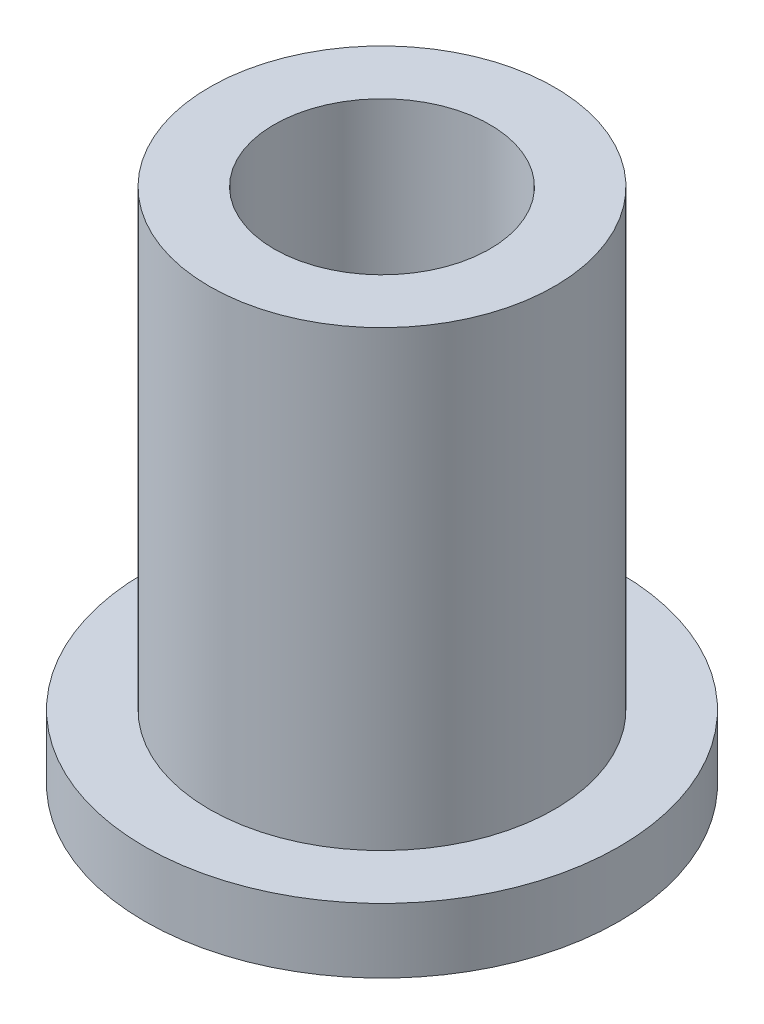
ISO-10303-21;
HEADER;
FILE_DESCRIPTION(('STEP AP214'),'2;1');
FILE_NAME('part.step','',(''),(''),'','','');
FILE_SCHEMA(('AUTOMOTIVE_DESIGN { 1 0 10303 214 1 1 1 1 }'));
ENDSEC;
DATA;
#1=APPLICATION_CONTEXT('core data for automotive mechanical design processes');
#2=APPLICATION_PROTOCOL_DEFINITION('international standard','automotive_design',2000,#1);
#3=PRODUCT_CONTEXT('',#1,'mechanical');
#4=PRODUCT('Part','Part','',(#3));
#5=PRODUCT_RELATED_PRODUCT_CATEGORY('part','',(#4));
#6=PRODUCT_DEFINITION_FORMATION('','',#4);
#7=PRODUCT_DEFINITION_CONTEXT('part definition',#1,'design');
#8=PRODUCT_DEFINITION('design','',#6,#7);
#9=PRODUCT_DEFINITION_SHAPE('','',#8);
#10=(LENGTH_UNIT() NAMED_UNIT(*) SI_UNIT(.MILLI.,.METRE.));
#11=(NAMED_UNIT(*) PLANE_ANGLE_UNIT() SI_UNIT($,.RADIAN.));
#12=(NAMED_UNIT(*) SI_UNIT($,.STERADIAN.) SOLID_ANGLE_UNIT());
#13=UNCERTAINTY_MEASURE_WITH_UNIT(LENGTH_MEASURE(1.E-05),#10,'distance_accuracy_value','');
#14=(GEOMETRIC_REPRESENTATION_CONTEXT(3) GLOBAL_UNCERTAINTY_ASSIGNED_CONTEXT((#13)) GLOBAL_UNIT_ASSIGNED_CONTEXT((#10,
#11,#12)) REPRESENTATION_CONTEXT('',''));
#15=CARTESIAN_POINT('',(0.,0.,0.));
#16=DIRECTION('',(0.,0.,1.));
#17=DIRECTION('',(1.,0.,0.));
#18=AXIS2_PLACEMENT_3D('',#15,#16,#17);
#19=CARTESIAN_POINT('',(0.,12.,0.));
#20=DIRECTION('',(0.,1.,0.));
#21=DIRECTION('',(0.,0.,1.));
#22=AXIS2_PLACEMENT_3D('',#19,#20,#21);
#23=PLANE('',#22);
#24=CARTESIAN_POINT('',(0.,12.,0.));
#25=DIRECTION('',(0.,1.,0.));
#26=DIRECTION('',(0.,0.,1.));
#27=AXIS2_PLACEMENT_3D('',#24,#25,#26);
#28=CIRCLE('',#27,4.);
#29=CARTESIAN_POINT('',(0.,12.,4.));
#30=VERTEX_POINT('',#29);
#31=EDGE_CURVE('E10',#30,#30,#28,.T.);
#32=ORIENTED_EDGE('',*,*,#31,.T.);
#33=EDGE_LOOP('',(#32));
#34=FACE_BOUND('',#33,.T.);
#35=CARTESIAN_POINT('',(0.,12.,0.));
#36=DIRECTION('',(0.,1.,0.));
#37=DIRECTION('',(0.,0.,1.));
#38=AXIS2_PLACEMENT_3D('',#35,#36,#37);
#39=CIRCLE('',#38,2.5);
#40=CARTESIAN_POINT('',(0.,12.,2.5));
#41=VERTEX_POINT('',#40);
#42=EDGE_CURVE('E37',#41,#41,#39,.T.);
#43=ORIENTED_EDGE('',*,*,#42,.F.);
#44=EDGE_LOOP('',(#43));
#45=FACE_BOUND('',#44,.T.);
#46=ADVANCED_FACE('F30',(#34,#45),#23,.T.);
#47=CARTESIAN_POINT('',(0.,0.,0.));
#48=DIRECTION('',(0.,1.,0.));
#49=DIRECTION('',(0.,0.,1.));
#50=AXIS2_PLACEMENT_3D('',#47,#48,#49);
#51=PLANE('',#50);
#52=CARTESIAN_POINT('',(0.,0.,0.));
#53=DIRECTION('',(0.,1.,0.));
#54=DIRECTION('',(0.,0.,1.));
#55=AXIS2_PLACEMENT_3D('',#52,#53,#54);
#56=CIRCLE('',#55,2.5);
#57=CARTESIAN_POINT('',(0.,0.,2.5));
#58=VERTEX_POINT('',#57);
#59=EDGE_CURVE('E41',#58,#58,#56,.T.);
#60=ORIENTED_EDGE('',*,*,#59,.T.);
#61=EDGE_LOOP('',(#60));
#62=FACE_BOUND('',#61,.T.);
#63=CARTESIAN_POINT('',(0.,0.,0.));
#64=DIRECTION('',(0.,1.,0.));
#65=DIRECTION('',(0.,0.,1.));
#66=AXIS2_PLACEMENT_3D('',#63,#64,#65);
#67=CIRCLE('',#66,5.5);
#68=CARTESIAN_POINT('',(0.,0.,5.5));
#69=VERTEX_POINT('',#68);
#70=EDGE_CURVE('E48',#69,#69,#67,.T.);
#71=ORIENTED_EDGE('',*,*,#70,.F.);
#72=EDGE_LOOP('',(#71));
#73=FACE_BOUND('',#72,.T.);
#74=ADVANCED_FACE('F73',(#62,#73),#51,.F.);
#75=CARTESIAN_POINT('',(0.,12.,0.));
#76=DIRECTION('',(0.,-1.,0.));
#77=DIRECTION('',(0.,0.,-1.));
#78=AXIS2_PLACEMENT_3D('',#75,#76,#77);
#79=CYLINDRICAL_SURFACE('',#78,4.);
#80=CARTESIAN_POINT('',(0.,1.5,0.));
#81=DIRECTION('',(0.,1.,0.));
#82=DIRECTION('',(0.,0.,1.));
#83=AXIS2_PLACEMENT_3D('',#80,#81,#82);
#84=CIRCLE('',#83,4.);
#85=CARTESIAN_POINT('',(0.,1.5,4.));
#86=VERTEX_POINT('',#85);
#87=EDGE_CURVE('E51',#86,#86,#84,.T.);
#88=ORIENTED_EDGE('',*,*,#87,.T.);
#89=EDGE_LOOP('',(#88));
#90=FACE_BOUND('',#89,.T.);
#91=ORIENTED_EDGE('',*,*,#31,.F.);
#92=EDGE_LOOP('',(#91));
#93=FACE_BOUND('',#92,.T.);
#94=ADVANCED_FACE('F32',(#90,#93),#79,.T.);
#95=CARTESIAN_POINT('',(0.,12.,0.));
#96=DIRECTION('',(0.,-1.,0.));
#97=DIRECTION('',(0.,0.,-1.));
#98=AXIS2_PLACEMENT_3D('',#95,#96,#97);
#99=CYLINDRICAL_SURFACE('',#98,2.5);
#100=ORIENTED_EDGE('',*,*,#42,.T.);
#101=EDGE_LOOP('',(#100));
#102=FACE_BOUND('',#101,.T.);
#103=ORIENTED_EDGE('',*,*,#59,.F.);
#104=EDGE_LOOP('',(#103));
#105=FACE_BOUND('',#104,.T.);
#106=ADVANCED_FACE('F62',(#102,#105),#99,.F.);
#107=CARTESIAN_POINT('',(0.,1.5,0.));
#108=DIRECTION('',(0.,1.,0.));
#109=DIRECTION('',(0.,0.,1.));
#110=AXIS2_PLACEMENT_3D('',#107,#108,#109);
#111=PLANE('',#110);
#112=CARTESIAN_POINT('',(0.,1.5,0.));
#113=DIRECTION('',(0.,1.,0.));
#114=DIRECTION('',(0.,0.,1.));
#115=AXIS2_PLACEMENT_3D('',#112,#113,#114);
#116=CIRCLE('',#115,5.5);
#117=CARTESIAN_POINT('',(0.,1.5,5.5));
#118=VERTEX_POINT('',#117);
#119=EDGE_CURVE('E46',#118,#118,#116,.T.);
#120=ORIENTED_EDGE('',*,*,#119,.T.);
#121=EDGE_LOOP('',(#120));
#122=FACE_BOUND('',#121,.T.);
#123=ORIENTED_EDGE('',*,*,#87,.F.);
#124=EDGE_LOOP('',(#123));
#125=FACE_BOUND('',#124,.T.);
#126=ADVANCED_FACE('F59',(#122,#125),#111,.T.);
#127=CARTESIAN_POINT('',(0.,1.5,0.));
#128=DIRECTION('',(0.,-1.,0.));
#129=DIRECTION('',(0.,0.,-1.));
#130=AXIS2_PLACEMENT_3D('',#127,#128,#129);
#131=CYLINDRICAL_SURFACE('',#130,5.5);
#132=ORIENTED_EDGE('',*,*,#119,.F.);
#133=EDGE_LOOP('',(#132));
#134=FACE_BOUND('',#133,.T.);
#135=ORIENTED_EDGE('',*,*,#70,.T.);
#136=EDGE_LOOP('',(#135));
#137=FACE_BOUND('',#136,.T.);
#138=ADVANCED_FACE('F61',(#134,#137),#131,.T.);
#139=CLOSED_SHELL('',(#46,#74,#94,#106,#126,#138));
#140=MANIFOLD_SOLID_BREP('B2',#139);
#141=ADVANCED_BREP_SHAPE_REPRESENTATION('',(#18,#140),#14);
#142=SHAPE_DEFINITION_REPRESENTATION(#9,#141);
ENDSEC;
END-ISO-10303-21;
